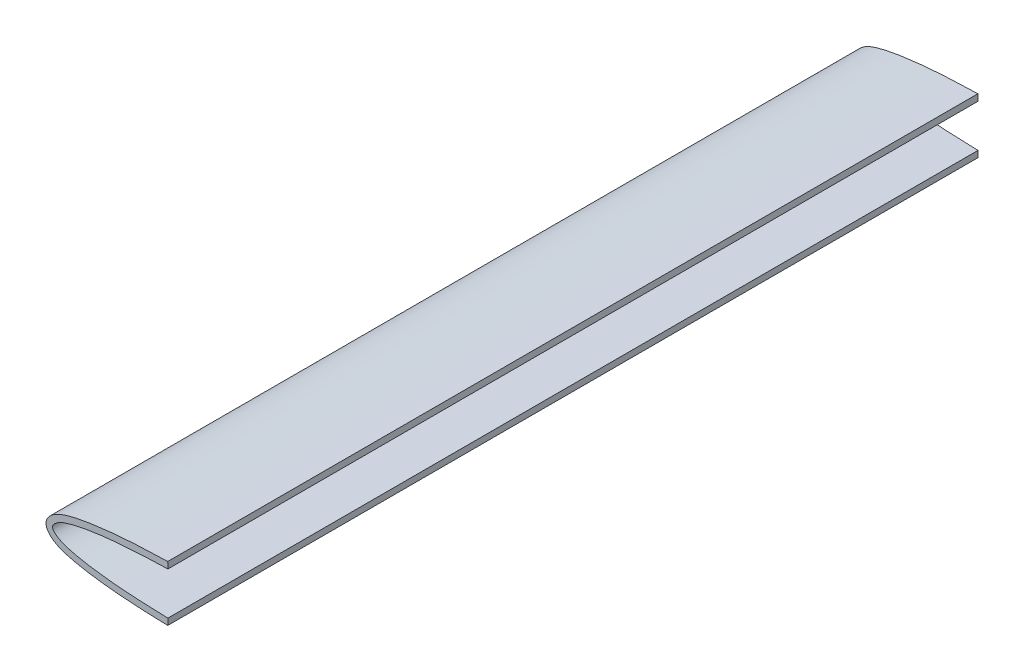
ISO-10303-21;
HEADER;
FILE_DESCRIPTION(('STEP AP214'),'2;1');
FILE_NAME('part.step','',(''),(''),'','','');
FILE_SCHEMA(('AUTOMOTIVE_DESIGN { 1 0 10303 214 1 1 1 1 }'));
ENDSEC;
DATA;
#1=APPLICATION_CONTEXT('core data for automotive mechanical design processes');
#2=APPLICATION_PROTOCOL_DEFINITION('international standard','automotive_design',2000,#1);
#3=PRODUCT_CONTEXT('',#1,'mechanical');
#4=PRODUCT('Part','Part','',(#3));
#5=PRODUCT_RELATED_PRODUCT_CATEGORY('part','',(#4));
#6=PRODUCT_DEFINITION_FORMATION('','',#4);
#7=PRODUCT_DEFINITION_CONTEXT('part definition',#1,'design');
#8=PRODUCT_DEFINITION('design','',#6,#7);
#9=PRODUCT_DEFINITION_SHAPE('','',#8);
#10=(LENGTH_UNIT() NAMED_UNIT(*) SI_UNIT(.MILLI.,.METRE.));
#11=(NAMED_UNIT(*) PLANE_ANGLE_UNIT() SI_UNIT($,.RADIAN.));
#12=(NAMED_UNIT(*) SI_UNIT($,.STERADIAN.) SOLID_ANGLE_UNIT());
#13=UNCERTAINTY_MEASURE_WITH_UNIT(LENGTH_MEASURE(1.E-05),#10,'distance_accuracy_value','');
#14=(GEOMETRIC_REPRESENTATION_CONTEXT(3) GLOBAL_UNCERTAINTY_ASSIGNED_CONTEXT((#13)) GLOBAL_UNIT_ASSIGNED_CONTEXT((#10,
#11,#12)) REPRESENTATION_CONTEXT('',''));
#15=CARTESIAN_POINT('',(0.,0.,0.));
#16=DIRECTION('',(0.,0.,1.));
#17=DIRECTION('',(1.,0.,0.));
#18=AXIS2_PLACEMENT_3D('',#15,#16,#17);
#19=CARTESIAN_POINT('',(40.8429404773556,9.81985352920851,287.02));
#20=CARTESIAN_POINT('',(39.0559639376873,9.77993010955937,287.02));
#21=CARTESIAN_POINT('',(35.4835377019917,9.67491897422681,287.02));
#22=CARTESIAN_POINT('',(30.121954538794,9.42975242547577,287.02));
#23=CARTESIAN_POINT('',(24.7546814717268,9.07649986857679,287.02));
#24=CARTESIAN_POINT('',(20.2776369133276,8.66895948674097,287.02));
#25=CARTESIAN_POINT('',(16.6940158284147,8.2482582926671,287.02));
#26=CARTESIAN_POINT('',(14.0089023963153,7.87970438100303,287.02));
#27=CARTESIAN_POINT('',(11.3223773689427,7.45069667674718,287.02));
#28=CARTESIAN_POINT('',(8.63133697726309,6.94074976833769,287.02));
#29=CARTESIAN_POINT('',(6.37471172187577,6.42233793974791,287.02));
#30=CARTESIAN_POINT('',(4.53816565107656,5.89264084562153,287.02));
#31=CARTESIAN_POINT('',(3.14757980254605,5.41235010871411,287.02));
#32=CARTESIAN_POINT('',(1.96280438608276,4.90111789355366,287.02));
#33=CARTESIAN_POINT('',(1.00459521677503,4.38244140436917,287.02));
#34=CARTESIAN_POINT('',(0.288845401162973,3.92572499247336,287.02));
#35=CARTESIAN_POINT('',(-0.421819232779744,3.37443544275704,287.02));
#36=CARTESIAN_POINT('',(-0.968913589356644,2.8577923677384,287.02));
#37=CARTESIAN_POINT('',(-1.44198382985463,2.29909857102904,287.02));
#38=CARTESIAN_POINT('',(-1.78049145786596,1.79282248967656,287.02));
#39=CARTESIAN_POINT('',(-2.05331839391579,1.25570252960157,287.02));
#40=CARTESIAN_POINT('',(-2.24053963673477,0.619706764601215,287.02));
#41=CARTESIAN_POINT('',(-2.30873018219419,3.11712936820925E-08,287.02));
#42=CARTESIAN_POINT('',(-2.24053963462045,-0.61970669840699,287.02));
#43=CARTESIAN_POINT('',(-2.05331839102291,-1.25570246093014,287.02));
#44=CARTESIAN_POINT('',(-1.78049145552213,-1.79282241820976,287.02));
#45=CARTESIAN_POINT('',(-1.44198382718042,-2.29909849938165,287.02));
#46=CARTESIAN_POINT('',(-0.968913587231577,-2.85779229478744,287.02));
#47=CARTESIAN_POINT('',(-0.421819230754899,-3.37443536973732,287.02));
#48=CARTESIAN_POINT('',(0.288845403035584,-3.9257249192314,287.02));
#49=CARTESIAN_POINT('',(1.00459521848544,-4.38244133108039,287.02));
#50=CARTESIAN_POINT('',(1.96280438751329,-4.90111782025488,287.02));
#51=CARTESIAN_POINT('',(3.14757980370866,-5.41235003560734,287.02));
#52=CARTESIAN_POINT('',(4.5381656519551,-5.89264077287968,287.02));
#53=CARTESIAN_POINT('',(6.37471172245455,-6.42233786759704,287.02));
#54=CARTESIAN_POINT('',(8.63133697756842,-6.94074969705077,287.02));
#55=CARTESIAN_POINT('',(11.3223773690152,-7.45069660656179,287.02));
#56=CARTESIAN_POINT('',(14.0089023961841,-7.87970431194563,287.02));
#57=CARTESIAN_POINT('',(16.6940158281226,-8.24825822475555,287.02));
#58=CARTESIAN_POINT('',(20.2776369128459,-8.6689594203663,287.02));
#59=CARTESIAN_POINT('',(24.7546814710535,-9.07649980414508,287.02));
#60=CARTESIAN_POINT('',(30.1219545379615,-9.42975236339738,287.02));
#61=CARTESIAN_POINT('',(35.4835377010446,-9.67491891451831,287.02));
#62=CARTESIAN_POINT('',(39.0559639366909,-9.77993005143195,287.02));
#63=CARTESIAN_POINT('',(40.84294047634,-9.8198534718752,287.02));
#64=B_SPLINE_CURVE_WITH_KNOTS('',3,(#19,#20,#21,#22,#23,#24,#25,#26,#27,#28,#29,#30,#31,#32,#33,
#34,#35,#36,#37,#38,#39,#40,#41,#42,#43,#44,#45,#46,#47,#48,#49,#50,#51,#52,#53,#54,#55,#56,#57,
#58,#59,#60,#61,#62,#63),.UNSPECIFIED.,.F.,.F.,(4,1,1,1,1,1,1,1,1,1,1,1,1,1,1,1,1,1,1,1,1,1,1,1,
1,1,1,1,1,1,1,1,1,1,1,1,1,1,1,1,1,1,4),(0.375677589335768,0.39121789066942,0.406758192003071,
0.422298493336722,0.437838794670374,0.445608945337199,0.453379096004025,0.461149246670851,
0.468919397337677,0.476689548004502,0.480574623337915,0.484459698671328,0.488344774004741,
0.490287311671447,0.492229849338154,0.49417238700486,0.496114924671566,0.49708619350492,
0.498057462338273,0.499028731171626,0.499514365588303,0.500000000004979,0.500485634421656,
0.500971268838333,0.501942537671686,0.502913806505039,0.503885075338392,0.505827613005099,
0.507770150671805,0.509712688338511,0.511655226005218,0.515540301338631,0.519425376672044,
0.523310452005457,0.531080602672282,0.538850753339108,0.546620904005934,0.554391054672759,
0.562161205339585,0.577701506673236,0.593241808006888,0.608782109340539,0.624322410674191),.UNSPECIFIED.);
#65=DIRECTION('',(0.,0.,-1.));
#66=VECTOR('',#65,1.);
#67=SURFACE_OF_LINEAR_EXTRUSION('',#64,#66);
#68=CARTESIAN_POINT('',(40.8429404773556,9.81985352920851,0.));
#69=CARTESIAN_POINT('',(39.0559639376873,9.77993010955937,0.));
#70=CARTESIAN_POINT('',(35.4835377019917,9.67491897422681,0.));
#71=CARTESIAN_POINT('',(30.121954538794,9.42975242547577,0.));
#72=CARTESIAN_POINT('',(24.7546814717268,9.07649986857679,0.));
#73=CARTESIAN_POINT('',(20.2776369133276,8.66895948674097,0.));
#74=CARTESIAN_POINT('',(16.6940158284147,8.2482582926671,0.));
#75=CARTESIAN_POINT('',(14.0089023963153,7.87970438100303,0.));
#76=CARTESIAN_POINT('',(11.3223773689427,7.45069667674718,0.));
#77=CARTESIAN_POINT('',(8.63133697726309,6.94074976833769,0.));
#78=CARTESIAN_POINT('',(6.37471172187577,6.42233793974791,0.));
#79=CARTESIAN_POINT('',(4.53816565107656,5.89264084562153,0.));
#80=CARTESIAN_POINT('',(3.14757980254605,5.41235010871411,0.));
#81=CARTESIAN_POINT('',(1.96280438608276,4.90111789355366,0.));
#82=CARTESIAN_POINT('',(1.00459521677503,4.38244140436917,0.));
#83=CARTESIAN_POINT('',(0.288845401162973,3.92572499247336,0.));
#84=CARTESIAN_POINT('',(-0.421819232779744,3.37443544275704,0.));
#85=CARTESIAN_POINT('',(-0.968913589356644,2.8577923677384,0.));
#86=CARTESIAN_POINT('',(-1.44198382985463,2.29909857102904,0.));
#87=CARTESIAN_POINT('',(-1.78049145786596,1.79282248967656,0.));
#88=CARTESIAN_POINT('',(-2.05331839391579,1.25570252960157,0.));
#89=CARTESIAN_POINT('',(-2.24053963673477,0.619706764601215,0.));
#90=CARTESIAN_POINT('',(-2.30873018219419,3.11712936820925E-08,0.));
#91=CARTESIAN_POINT('',(-2.24053963462045,-0.61970669840699,0.));
#92=CARTESIAN_POINT('',(-2.05331839102291,-1.25570246093014,0.));
#93=CARTESIAN_POINT('',(-1.78049145552213,-1.79282241820976,0.));
#94=CARTESIAN_POINT('',(-1.44198382718042,-2.29909849938165,0.));
#95=CARTESIAN_POINT('',(-0.968913587231577,-2.85779229478744,0.));
#96=CARTESIAN_POINT('',(-0.421819230754899,-3.37443536973732,0.));
#97=CARTESIAN_POINT('',(0.288845403035584,-3.9257249192314,0.));
#98=CARTESIAN_POINT('',(1.00459521848544,-4.38244133108039,0.));
#99=CARTESIAN_POINT('',(1.96280438751329,-4.90111782025488,0.));
#100=CARTESIAN_POINT('',(3.14757980370866,-5.41235003560734,0.));
#101=CARTESIAN_POINT('',(4.5381656519551,-5.89264077287968,0.));
#102=CARTESIAN_POINT('',(6.37471172245455,-6.42233786759704,0.));
#103=CARTESIAN_POINT('',(8.63133697756842,-6.94074969705077,0.));
#104=CARTESIAN_POINT('',(11.3223773690152,-7.45069660656179,0.));
#105=CARTESIAN_POINT('',(14.0089023961841,-7.87970431194563,0.));
#106=CARTESIAN_POINT('',(16.6940158281226,-8.24825822475555,0.));
#107=CARTESIAN_POINT('',(20.2776369128459,-8.6689594203663,0.));
#108=CARTESIAN_POINT('',(24.7546814710535,-9.07649980414508,0.));
#109=CARTESIAN_POINT('',(30.1219545379615,-9.42975236339738,0.));
#110=CARTESIAN_POINT('',(35.4835377010446,-9.67491891451831,0.));
#111=CARTESIAN_POINT('',(39.0559639366909,-9.77993005143195,0.));
#112=CARTESIAN_POINT('',(40.84294047634,-9.8198534718752,0.));
#113=B_SPLINE_CURVE_WITH_KNOTS('',3,(#68,#69,#70,#71,#72,#73,#74,#75,#76,#77,#78,#79,#80,#81,
#82,#83,#84,#85,#86,#87,#88,#89,#90,#91,#92,#93,#94,#95,#96,#97,#98,#99,#100,#101,#102,#103,
#104,#105,#106,#107,#108,#109,#110,#111,#112),.UNSPECIFIED.,.F.,.F.,(4,1,1,1,1,1,1,1,1,1,1,1,1,
1,1,1,1,1,1,1,1,1,1,1,1,1,1,1,1,1,1,1,1,1,1,1,1,1,1,1,1,1,4),(0.375677589335768,
0.39121789066942,0.406758192003071,0.422298493336722,0.437838794670374,0.445608945337199,
0.453379096004025,0.461149246670851,0.468919397337677,0.476689548004502,0.480574623337915,
0.484459698671328,0.488344774004741,0.490287311671447,0.492229849338154,0.49417238700486,
0.496114924671566,0.49708619350492,0.498057462338273,0.499028731171626,0.499514365588303,
0.500000000004979,0.500485634421656,0.500971268838333,0.501942537671686,0.502913806505039,
0.503885075338392,0.505827613005099,0.507770150671805,0.509712688338511,0.511655226005218,
0.515540301338631,0.519425376672044,0.523310452005457,0.531080602672282,0.538850753339108,
0.546620904005934,0.554391054672759,0.562161205339585,0.577701506673236,0.593241808006888,
0.608782109340539,0.624322410674191),.UNSPECIFIED.);
#114=CARTESIAN_POINT('',(40.8429404773556,9.81985352920851,0.));
#115=VERTEX_POINT('',#114);
#116=CARTESIAN_POINT('',(40.84294047634,-9.8198534718752,0.));
#117=VERTEX_POINT('',#116);
#118=EDGE_CURVE('E116',#115,#117,#113,.T.);
#119=ORIENTED_EDGE('',*,*,#118,.T.);
#120=DIRECTION('',(0.,0.,-1.));
#121=VECTOR('',#120,1.);
#122=CARTESIAN_POINT('',(40.84294047634,-9.8198534718752,287.02));
#123=LINE('',#122,#121);
#124=CARTESIAN_POINT('',(40.84294047634,-9.8198534718752,287.02));
#125=VERTEX_POINT('',#124);
#126=EDGE_CURVE('E11',#125,#117,#123,.T.);
#127=ORIENTED_EDGE('',*,*,#126,.F.);
#128=CARTESIAN_POINT('',(40.8429404773556,9.81985352920851,287.02));
#129=VERTEX_POINT('',#128);
#130=EDGE_CURVE('E85',#129,#125,#64,.T.);
#131=ORIENTED_EDGE('',*,*,#130,.F.);
#132=DIRECTION('',(0.,0.,-1.));
#133=VECTOR('',#132,1.);
#134=CARTESIAN_POINT('',(40.8429404773556,9.81985352920851,287.02));
#135=LINE('',#134,#133);
#136=EDGE_CURVE('E93',#129,#115,#135,.T.);
#137=ORIENTED_EDGE('',*,*,#136,.T.);
#138=EDGE_LOOP('',(#119,#127,#131,#137));
#139=FACE_BOUND('',#138,.T.);
#140=ADVANCED_FACE('F33',(#139),#67,.F.);
#141=CARTESIAN_POINT('',(40.84294047634,-9.8198534718752,287.02));
#142=DIRECTION('',(-0.999750526025544,0.0223357496325687,0.));
#143=DIRECTION('',(-0.0223357496325687,-0.999750526025544,0.));
#144=AXIS2_PLACEMENT_3D('',#141,#142,#143);
#145=PLANE('',#144);
#146=DIRECTION('',(0.0223357496325687,0.999750526025544,0.));
#147=VECTOR('',#146,1.);
#148=CARTESIAN_POINT('',(40.84294047634,-9.8198534718752,0.));
#149=LINE('',#148,#147);
#150=CARTESIAN_POINT('',(40.894,-7.5344237693808,0.));
#151=VERTEX_POINT('',#150);
#152=EDGE_CURVE('E89',#117,#151,#149,.T.);
#153=ORIENTED_EDGE('',*,*,#152,.T.);
#154=DIRECTION('',(0.,0.,-1.));
#155=VECTOR('',#154,1.);
#156=CARTESIAN_POINT('',(40.894,-7.5344237693808,287.02));
#157=LINE('',#156,#155);
#158=CARTESIAN_POINT('',(40.894,-7.5344237693808,287.02));
#159=VERTEX_POINT('',#158);
#160=EDGE_CURVE('E42',#159,#151,#157,.T.);
#161=ORIENTED_EDGE('',*,*,#160,.F.);
#162=DIRECTION('',(0.0223357496325687,0.999750526025544,0.));
#163=VECTOR('',#162,1.);
#164=CARTESIAN_POINT('',(40.84294047634,-9.8198534718752,287.02));
#165=LINE('',#164,#163);
#166=EDGE_CURVE('E80',#125,#159,#165,.T.);
#167=ORIENTED_EDGE('',*,*,#166,.F.);
#168=ORIENTED_EDGE('',*,*,#126,.T.);
#169=EDGE_LOOP('',(#153,#161,#167,#168));
#170=FACE_BOUND('',#169,.T.);
#171=ADVANCED_FACE('F88',(#170),#145,.F.);
#172=CARTESIAN_POINT('',(40.894,-7.5344237693808,287.02));
#173=CARTESIAN_POINT('',(39.8080857108308,-7.51016300726674,287.02));
#174=CARTESIAN_POINT('',(37.2204538262729,-7.44175377897424,287.02));
#175=CARTESIAN_POINT('',(33.2049306238562,-7.28820307547838,287.02));
#176=CARTESIAN_POINT('',(28.9269503637119,-7.06433359716364,287.02));
#177=CARTESIAN_POINT('',(24.8872051324296,-6.78339398332566,287.02));
#178=CARTESIAN_POINT('',(21.1028244171446,-6.45013797484564,287.02));
#179=CARTESIAN_POINT('',(17.5912365652161,-6.06164770191014,287.02));
#180=CARTESIAN_POINT('',(14.367078537437,-5.62532936355191,287.02));
#181=CARTESIAN_POINT('',(11.4429569430172,-5.15243091362526,287.02));
#182=CARTESIAN_POINT('',(8.83104990848167,-4.6450704502367,287.02));
#183=CARTESIAN_POINT('',(6.53984231861846,-4.10500627011699,287.02));
#184=CARTESIAN_POINT('',(4.58018440659535,-3.51405062392187,287.02));
#185=CARTESIAN_POINT('',(2.9563296649499,-2.86125785229416,287.02));
#186=CARTESIAN_POINT('',(1.68313620536241,-2.14099085277401,287.02));
#187=CARTESIAN_POINT('',(0.767554784553446,-1.38887314932969,287.02));
#188=CARTESIAN_POINT('',(0.195767806882433,-0.699527409820872,287.02));
#189=CARTESIAN_POINT('',(-0.0801081550509971,3.79736787786542E-08,287.02));
#190=CARTESIAN_POINT('',(0.195767807199276,0.699527485643207,287.02));
#191=CARTESIAN_POINT('',(0.767554785182608,1.38887322489308,287.02));
#192=CARTESIAN_POINT('',(1.68313620633223,2.1409909279226,287.02));
#193=CARTESIAN_POINT('',(2.95632966624601,2.86125792686606,287.02));
#194=CARTESIAN_POINT('',(4.58018440818713,3.51405069775817,287.02));
#195=CARTESIAN_POINT('',(6.53984232047796,4.10500634306563,287.02));
#196=CARTESIAN_POINT('',(8.83104991058575,4.64507052214745,287.02));
#197=CARTESIAN_POINT('',(11.4429569453512,5.15243098435287,287.02));
#198=CARTESIAN_POINT('',(14.3670785399851,5.62532943295495,287.02));
#199=CARTESIAN_POINT('',(17.5912365679619,6.06164776985269,287.02));
#200=CARTESIAN_POINT('',(21.1028244200665,6.45013804119752,287.02));
#201=CARTESIAN_POINT('',(24.8872051355023,6.78339404796329,287.02));
#202=CARTESIAN_POINT('',(28.926950366912,7.06433365997135,287.02));
#203=CARTESIAN_POINT('',(33.2049306271576,7.28820313634824,287.02));
#204=CARTESIAN_POINT('',(37.2204538285067,7.44175383798167,287.02));
#205=CARTESIAN_POINT('',(39.8080857119577,7.51016306508537,287.02));
#206=CARTESIAN_POINT('',(40.894,7.53442382669143,287.02));
#207=B_SPLINE_CURVE_WITH_KNOTS('',3,(#172,#173,#174,#175,#176,#177,#178,#179,#180,#181,#182,
#183,#184,#185,#186,#187,#188,#189,#190,#191,#192,#193,#194,#195,#196,#197,#198,#199,#200,#201,
#202,#203,#204,#205,#206),.UNSPECIFIED.,.F.,.F.,(4,1,1,1,1,1,1,1,1,1,1,1,1,1,1,1,1,1,1,1,1,1,1,
1,1,1,1,1,1,1,1,1,4),(0.375677589335768,0.385183441052592,0.398331272594671,0.410844637201373,
0.422672607177271,0.433769314483458,0.444090175238737,0.453589411792115,0.462240439854436,
0.47001003733525,0.476870984686958,0.482833353073459,0.487908551361243,0.492155163593134,
0.4955922734038,0.49819635899467,0.500000000009959,0.501803641025247,0.504407726616117,
0.507844836426784,0.512091448658675,0.517166646946458,0.523129015332959,0.529989962684668,
0.537759560165482,0.546410588227802,0.555909824781181,0.566230685536459,0.577327392842646,
0.589155362818545,0.601668727425246,0.614816558967326,0.624322410674191),.UNSPECIFIED.);
#208=DIRECTION('',(0.,0.,-1.));
#209=VECTOR('',#208,1.);
#210=SURFACE_OF_LINEAR_EXTRUSION('',#207,#209);
#211=CARTESIAN_POINT('',(40.894,-7.5344237693808,0.));
#212=CARTESIAN_POINT('',(39.8080857108308,-7.51016300726674,0.));
#213=CARTESIAN_POINT('',(37.2204538262729,-7.44175377897424,0.));
#214=CARTESIAN_POINT('',(33.2049306238562,-7.28820307547838,0.));
#215=CARTESIAN_POINT('',(28.9269503637119,-7.06433359716364,0.));
#216=CARTESIAN_POINT('',(24.8872051324296,-6.78339398332566,0.));
#217=CARTESIAN_POINT('',(21.1028244171446,-6.45013797484564,0.));
#218=CARTESIAN_POINT('',(17.5912365652161,-6.06164770191014,0.));
#219=CARTESIAN_POINT('',(14.367078537437,-5.62532936355191,0.));
#220=CARTESIAN_POINT('',(11.4429569430172,-5.15243091362526,0.));
#221=CARTESIAN_POINT('',(8.83104990848167,-4.6450704502367,0.));
#222=CARTESIAN_POINT('',(6.53984231861846,-4.10500627011699,0.));
#223=CARTESIAN_POINT('',(4.58018440659535,-3.51405062392187,0.));
#224=CARTESIAN_POINT('',(2.9563296649499,-2.86125785229416,0.));
#225=CARTESIAN_POINT('',(1.68313620536241,-2.14099085277401,0.));
#226=CARTESIAN_POINT('',(0.767554784553446,-1.38887314932969,0.));
#227=CARTESIAN_POINT('',(0.195767806882433,-0.699527409820872,0.));
#228=CARTESIAN_POINT('',(-0.0801081550509971,3.79736787786542E-08,0.));
#229=CARTESIAN_POINT('',(0.195767807199276,0.699527485643207,0.));
#230=CARTESIAN_POINT('',(0.767554785182608,1.38887322489308,0.));
#231=CARTESIAN_POINT('',(1.68313620633223,2.1409909279226,0.));
#232=CARTESIAN_POINT('',(2.95632966624601,2.86125792686606,0.));
#233=CARTESIAN_POINT('',(4.58018440818713,3.51405069775817,0.));
#234=CARTESIAN_POINT('',(6.53984232047796,4.10500634306563,0.));
#235=CARTESIAN_POINT('',(8.83104991058575,4.64507052214745,0.));
#236=CARTESIAN_POINT('',(11.4429569453512,5.15243098435287,0.));
#237=CARTESIAN_POINT('',(14.3670785399851,5.62532943295495,0.));
#238=CARTESIAN_POINT('',(17.5912365679619,6.06164776985269,0.));
#239=CARTESIAN_POINT('',(21.1028244200665,6.45013804119752,0.));
#240=CARTESIAN_POINT('',(24.8872051355023,6.78339404796329,0.));
#241=CARTESIAN_POINT('',(28.926950366912,7.06433365997135,0.));
#242=CARTESIAN_POINT('',(33.2049306271576,7.28820313634824,0.));
#243=CARTESIAN_POINT('',(37.2204538285067,7.44175383798167,0.));
#244=CARTESIAN_POINT('',(39.8080857119577,7.51016306508537,0.));
#245=CARTESIAN_POINT('',(40.894,7.53442382669143,0.));
#246=B_SPLINE_CURVE_WITH_KNOTS('',3,(#211,#212,#213,#214,#215,#216,#217,#218,#219,#220,#221,
#222,#223,#224,#225,#226,#227,#228,#229,#230,#231,#232,#233,#234,#235,#236,#237,#238,#239,#240,
#241,#242,#243,#244,#245),.UNSPECIFIED.,.F.,.F.,(4,1,1,1,1,1,1,1,1,1,1,1,1,1,1,1,1,1,1,1,1,1,1,
1,1,1,1,1,1,1,1,1,4),(0.375677589335768,0.385183441052592,0.398331272594671,0.410844637201373,
0.422672607177271,0.433769314483458,0.444090175238737,0.453589411792115,0.462240439854436,
0.47001003733525,0.476870984686958,0.482833353073459,0.487908551361243,0.492155163593134,
0.4955922734038,0.49819635899467,0.500000000009959,0.501803641025247,0.504407726616117,
0.507844836426784,0.512091448658675,0.517166646946458,0.523129015332959,0.529989962684668,
0.537759560165482,0.546410588227802,0.555909824781181,0.566230685536459,0.577327392842646,
0.589155362818545,0.601668727425246,0.614816558967326,0.624322410674191),.UNSPECIFIED.);
#247=CARTESIAN_POINT('',(40.894,7.53442382669143,0.));
#248=VERTEX_POINT('',#247);
#249=EDGE_CURVE('E67',#151,#248,#246,.T.);
#250=ORIENTED_EDGE('',*,*,#249,.T.);
#251=DIRECTION('',(0.,0.,-1.));
#252=VECTOR('',#251,1.);
#253=CARTESIAN_POINT('',(40.894,7.53442382669143,287.02));
#254=LINE('',#253,#252);
#255=CARTESIAN_POINT('',(40.894,7.53442382669143,287.02));
#256=VERTEX_POINT('',#255);
#257=EDGE_CURVE('E90',#256,#248,#254,.T.);
#258=ORIENTED_EDGE('',*,*,#257,.F.);
#259=EDGE_CURVE('E83',#159,#256,#207,.T.);
#260=ORIENTED_EDGE('',*,*,#259,.F.);
#261=ORIENTED_EDGE('',*,*,#160,.T.);
#262=EDGE_LOOP('',(#250,#258,#260,#261));
#263=FACE_BOUND('',#262,.T.);
#264=ADVANCED_FACE('F91',(#263),#210,.F.);
#265=CARTESIAN_POINT('',(40.894,7.53442382669143,287.02));
#266=DIRECTION('',(-0.99975052603547,-0.022335749188273,0.));
#267=DIRECTION('',(0.022335749188273,-0.99975052603547,0.));
#268=AXIS2_PLACEMENT_3D('',#265,#266,#267);
#269=PLANE('',#268);
#270=DIRECTION('',(-0.022335749188273,0.99975052603547,0.));
#271=VECTOR('',#270,1.);
#272=CARTESIAN_POINT('',(40.894,7.53442382669143,0.));
#273=LINE('',#272,#271);
#274=EDGE_CURVE('E73',#248,#115,#273,.T.);
#275=ORIENTED_EDGE('',*,*,#274,.T.);
#276=ORIENTED_EDGE('',*,*,#136,.F.);
#277=DIRECTION('',(-0.022335749188273,0.99975052603547,0.));
#278=VECTOR('',#277,1.);
#279=CARTESIAN_POINT('',(40.894,7.53442382669143,287.02));
#280=LINE('',#279,#278);
#281=EDGE_CURVE('E50',#256,#129,#280,.T.);
#282=ORIENTED_EDGE('',*,*,#281,.F.);
#283=ORIENTED_EDGE('',*,*,#257,.T.);
#284=EDGE_LOOP('',(#275,#276,#282,#283));
#285=FACE_BOUND('',#284,.T.);
#286=ADVANCED_FACE('F105',(#285),#269,.F.);
#287=CARTESIAN_POINT('',(-2.286000000022,3.18132334711785E-08,287.02));
#288=DIRECTION('',(0.,0.,-1.));
#289=DIRECTION('',(-1.,0.,0.));
#290=AXIS2_PLACEMENT_3D('',#287,#288,#289);
#291=PLANE('',#290);
#292=ORIENTED_EDGE('',*,*,#130,.T.);
#293=ORIENTED_EDGE('',*,*,#166,.T.);
#294=ORIENTED_EDGE('',*,*,#259,.T.);
#295=ORIENTED_EDGE('',*,*,#281,.T.);
#296=EDGE_LOOP('',(#292,#293,#294,#295));
#297=FACE_BOUND('',#296,.T.);
#298=ADVANCED_FACE('F81',(#297),#291,.F.);
#299=CARTESIAN_POINT('',(-2.286000000022,3.18132334711785E-08,0.));
#300=DIRECTION('',(0.,0.,-1.));
#301=DIRECTION('',(-1.,0.,0.));
#302=AXIS2_PLACEMENT_3D('',#299,#300,#301);
#303=PLANE('',#302);
#304=ORIENTED_EDGE('',*,*,#118,.F.);
#305=ORIENTED_EDGE('',*,*,#274,.F.);
#306=ORIENTED_EDGE('',*,*,#249,.F.);
#307=ORIENTED_EDGE('',*,*,#152,.F.);
#308=EDGE_LOOP('',(#304,#305,#306,#307));
#309=FACE_BOUND('',#308,.T.);
#310=ADVANCED_FACE('F133',(#309),#303,.T.);
#311=CLOSED_SHELL('',(#140,#171,#264,#286,#298,#310));
#312=MANIFOLD_SOLID_BREP('B2',#311);
#313=ADVANCED_BREP_SHAPE_REPRESENTATION('',(#18,#312),#14);
#314=SHAPE_DEFINITION_REPRESENTATION(#9,#313);
ENDSEC;
END-ISO-10303-21;
